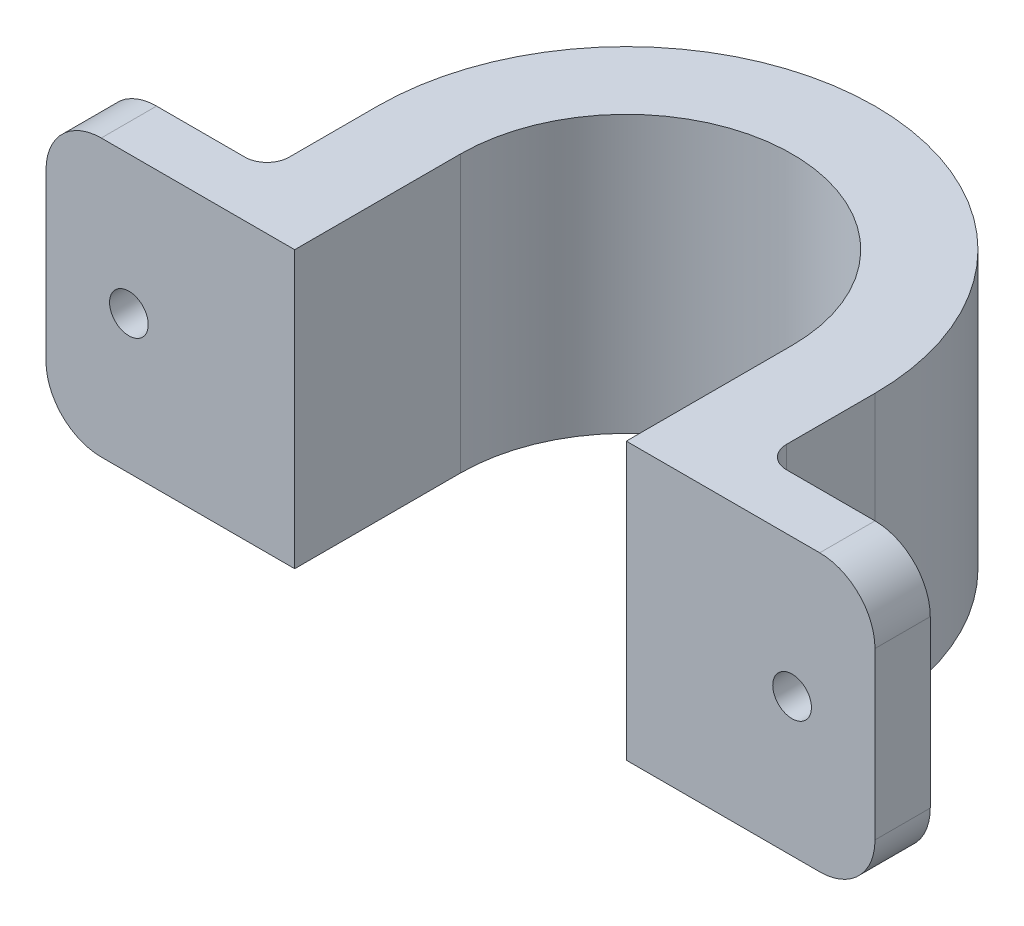
ISO-10303-21;
HEADER;
FILE_DESCRIPTION(('STEP AP214'),'2;1');
FILE_NAME('part.step','',(''),(''),'','','');
FILE_SCHEMA(('AUTOMOTIVE_DESIGN { 1 0 10303 214 1 1 1 1 }'));
ENDSEC;
DATA;
#1=APPLICATION_CONTEXT('core data for automotive mechanical design processes');
#2=APPLICATION_PROTOCOL_DEFINITION('international standard','automotive_design',2000,#1);
#3=PRODUCT_CONTEXT('',#1,'mechanical');
#4=PRODUCT('Part','Part','',(#3));
#5=PRODUCT_RELATED_PRODUCT_CATEGORY('part','',(#4));
#6=PRODUCT_DEFINITION_FORMATION('','',#4);
#7=PRODUCT_DEFINITION_CONTEXT('part definition',#1,'design');
#8=PRODUCT_DEFINITION('design','',#6,#7);
#9=PRODUCT_DEFINITION_SHAPE('','',#8);
#10=(LENGTH_UNIT() NAMED_UNIT(*) SI_UNIT(.MILLI.,.METRE.));
#11=(NAMED_UNIT(*) PLANE_ANGLE_UNIT() SI_UNIT($,.RADIAN.));
#12=(NAMED_UNIT(*) SI_UNIT($,.STERADIAN.) SOLID_ANGLE_UNIT());
#13=UNCERTAINTY_MEASURE_WITH_UNIT(LENGTH_MEASURE(1.E-05),#10,'distance_accuracy_value','');
#14=(GEOMETRIC_REPRESENTATION_CONTEXT(3) GLOBAL_UNCERTAINTY_ASSIGNED_CONTEXT((#13)) GLOBAL_UNIT_ASSIGNED_CONTEXT((#10,
#11,#12)) REPRESENTATION_CONTEXT('',''));
#15=CARTESIAN_POINT('',(0.,0.,0.));
#16=DIRECTION('',(0.,0.,1.));
#17=DIRECTION('',(1.,0.,0.));
#18=AXIS2_PLACEMENT_3D('',#15,#16,#17);
#19=CARTESIAN_POINT('',(0.,25.,15.));
#20=DIRECTION('',(-1.,0.,0.));
#21=DIRECTION('',(0.,0.,1.));
#22=AXIS2_PLACEMENT_3D('',#19,#20,#21);
#23=PLANE('',#22);
#24=DIRECTION('',(0.,0.,-1.));
#25=VECTOR('',#24,1.);
#26=CARTESIAN_POINT('',(0.,0.,15.));
#27=LINE('',#26,#25);
#28=CARTESIAN_POINT('',(0.,0.,15.));
#29=VERTEX_POINT('',#28);
#30=CARTESIAN_POINT('',(0.,0.,0.));
#31=VERTEX_POINT('',#30);
#32=EDGE_CURVE('E198',#29,#31,#27,.T.);
#33=ORIENTED_EDGE('',*,*,#32,.T.);
#34=DIRECTION('',(0.,-1.,0.));
#35=VECTOR('',#34,1.);
#36=CARTESIAN_POINT('',(0.,25.,0.));
#37=LINE('',#36,#35);
#38=CARTESIAN_POINT('',(0.,25.,0.));
#39=VERTEX_POINT('',#38);
#40=EDGE_CURVE('E175',#39,#31,#37,.T.);
#41=ORIENTED_EDGE('',*,*,#40,.F.);
#42=DIRECTION('',(0.,0.,-1.));
#43=VECTOR('',#42,1.);
#44=CARTESIAN_POINT('',(0.,25.,15.));
#45=LINE('',#44,#43);
#46=CARTESIAN_POINT('',(0.,25.,15.));
#47=VERTEX_POINT('',#46);
#48=EDGE_CURVE('E183',#47,#39,#45,.T.);
#49=ORIENTED_EDGE('',*,*,#48,.F.);
#50=DIRECTION('',(0.,-1.,0.));
#51=VECTOR('',#50,1.);
#52=CARTESIAN_POINT('',(0.,25.,15.));
#53=LINE('',#52,#51);
#54=EDGE_CURVE('E330',#47,#29,#53,.T.);
#55=ORIENTED_EDGE('',*,*,#54,.T.);
#56=EDGE_LOOP('',(#33,#41,#49,#55));
#57=FACE_BOUND('',#56,.T.);
#58=ADVANCED_FACE('F45',(#57),#23,.F.);
#59=CARTESIAN_POINT('',(15.,25.,0.));
#60=DIRECTION('',(0.,-1.,0.));
#61=DIRECTION('',(0.,0.,-1.));
#62=AXIS2_PLACEMENT_3D('',#59,#60,#61);
#63=CYLINDRICAL_SURFACE('',#62,15.);
#64=CARTESIAN_POINT('',(15.,0.,0.));
#65=DIRECTION('',(0.,-1.,0.));
#66=DIRECTION('',(0.,0.,-1.));
#67=AXIS2_PLACEMENT_3D('',#64,#65,#66);
#68=CIRCLE('',#67,15.);
#69=CARTESIAN_POINT('',(30.,0.,0.));
#70=VERTEX_POINT('',#69);
#71=EDGE_CURVE('E395',#31,#70,#68,.T.);
#72=ORIENTED_EDGE('',*,*,#71,.T.);
#73=DIRECTION('',(0.,-1.,0.));
#74=VECTOR('',#73,1.);
#75=CARTESIAN_POINT('',(30.,25.,0.));
#76=LINE('',#75,#74);
#77=CARTESIAN_POINT('',(30.,25.,0.));
#78=VERTEX_POINT('',#77);
#79=EDGE_CURVE('E178',#78,#70,#76,.T.);
#80=ORIENTED_EDGE('',*,*,#79,.F.);
#81=CARTESIAN_POINT('',(15.,25.,0.));
#82=DIRECTION('',(0.,-1.,0.));
#83=DIRECTION('',(0.,0.,-1.));
#84=AXIS2_PLACEMENT_3D('',#81,#82,#83);
#85=CIRCLE('',#84,15.);
#86=EDGE_CURVE('E171',#39,#78,#85,.T.);
#87=ORIENTED_EDGE('',*,*,#86,.F.);
#88=ORIENTED_EDGE('',*,*,#40,.T.);
#89=EDGE_LOOP('',(#72,#80,#87,#88));
#90=FACE_BOUND('',#89,.T.);
#91=ADVANCED_FACE('F173',(#90),#63,.F.);
#92=CARTESIAN_POINT('',(30.,25.,0.));
#93=DIRECTION('',(1.,0.,0.));
#94=DIRECTION('',(0.,0.,-1.));
#95=AXIS2_PLACEMENT_3D('',#92,#93,#94);
#96=PLANE('',#95);
#97=DIRECTION('',(0.,0.,1.));
#98=VECTOR('',#97,1.);
#99=CARTESIAN_POINT('',(30.,0.,0.));
#100=LINE('',#99,#98);
#101=CARTESIAN_POINT('',(30.,0.,15.));
#102=VERTEX_POINT('',#101);
#103=EDGE_CURVE('E316',#70,#102,#100,.T.);
#104=ORIENTED_EDGE('',*,*,#103,.T.);
#105=DIRECTION('',(0.,-1.,0.));
#106=VECTOR('',#105,1.);
#107=CARTESIAN_POINT('',(30.,25.,15.));
#108=LINE('',#107,#106);
#109=CARTESIAN_POINT('',(30.,25.,15.));
#110=VERTEX_POINT('',#109);
#111=EDGE_CURVE('E206',#110,#102,#108,.T.);
#112=ORIENTED_EDGE('',*,*,#111,.F.);
#113=DIRECTION('',(0.,0.,1.));
#114=VECTOR('',#113,1.);
#115=CARTESIAN_POINT('',(30.,25.,0.));
#116=LINE('',#115,#114);
#117=EDGE_CURVE('E182',#78,#110,#116,.T.);
#118=ORIENTED_EDGE('',*,*,#117,.F.);
#119=ORIENTED_EDGE('',*,*,#79,.T.);
#120=EDGE_LOOP('',(#104,#112,#118,#119));
#121=FACE_BOUND('',#120,.T.);
#122=ADVANCED_FACE('F399',(#121),#96,.F.);
#123=CARTESIAN_POINT('',(30.,25.,15.));
#124=DIRECTION('',(0.,0.,-1.));
#125=DIRECTION('',(-1.,0.,0.));
#126=AXIS2_PLACEMENT_3D('',#123,#124,#125);
#127=PLANE('',#126);
#128=CARTESIAN_POINT('',(45.,12.5,15.));
#129=DIRECTION('',(0.,0.,-1.));
#130=DIRECTION('',(-1.,0.,0.));
#131=AXIS2_PLACEMENT_3D('',#128,#129,#130);
#132=CIRCLE('',#131,1.75);
#133=CARTESIAN_POINT('',(43.25,12.5,15.));
#134=VERTEX_POINT('',#133);
#135=EDGE_CURVE('E396',#134,#134,#132,.T.);
#136=ORIENTED_EDGE('',*,*,#135,.T.);
#137=EDGE_LOOP('',(#136));
#138=FACE_BOUND('',#137,.T.);
#139=DIRECTION('',(0.,-1.,0.));
#140=VECTOR('',#139,1.);
#141=CARTESIAN_POINT('',(52.5,25.,15.));
#142=LINE('',#141,#140);
#143=CARTESIAN_POINT('',(52.5,20.,15.));
#144=VERTEX_POINT('',#143);
#145=CARTESIAN_POINT('',(52.5,5.,15.));
#146=VERTEX_POINT('',#145);
#147=EDGE_CURVE('E350',#144,#146,#142,.T.);
#148=ORIENTED_EDGE('',*,*,#147,.F.);
#149=CARTESIAN_POINT('',(47.5,20.,15.));
#150=DIRECTION('',(0.,0.,-1.));
#151=DIRECTION('',(-1.,0.,0.));
#152=AXIS2_PLACEMENT_3D('',#149,#150,#151);
#153=CIRCLE('',#152,5.);
#154=CARTESIAN_POINT('',(47.5,25.,15.));
#155=VERTEX_POINT('',#154);
#156=EDGE_CURVE('E229',#144,#155,#153,.F.);
#157=ORIENTED_EDGE('',*,*,#156,.T.);
#158=DIRECTION('',(1.,0.,0.));
#159=VECTOR('',#158,1.);
#160=CARTESIAN_POINT('',(30.,25.,15.));
#161=LINE('',#160,#159);
#162=EDGE_CURVE('E362',#110,#155,#161,.T.);
#163=ORIENTED_EDGE('',*,*,#162,.F.);
#164=ORIENTED_EDGE('',*,*,#111,.T.);
#165=DIRECTION('',(1.,0.,0.));
#166=VECTOR('',#165,1.);
#167=CARTESIAN_POINT('',(30.,0.,15.));
#168=LINE('',#167,#166);
#169=CARTESIAN_POINT('',(47.5,0.,15.));
#170=VERTEX_POINT('',#169);
#171=EDGE_CURVE('E309',#102,#170,#168,.T.);
#172=ORIENTED_EDGE('',*,*,#171,.T.);
#173=CARTESIAN_POINT('',(47.5,5.,15.));
#174=DIRECTION('',(0.,0.,-1.));
#175=DIRECTION('',(-1.,0.,0.));
#176=AXIS2_PLACEMENT_3D('',#173,#174,#175);
#177=CIRCLE('',#176,5.);
#178=EDGE_CURVE('E226',#170,#146,#177,.F.);
#179=ORIENTED_EDGE('',*,*,#178,.T.);
#180=EDGE_LOOP('',(#148,#157,#163,#164,#172,#179));
#181=FACE_BOUND('',#180,.T.);
#182=ADVANCED_FACE('F360',(#138,#181),#127,.F.);
#183=CARTESIAN_POINT('',(52.5,25.,15.));
#184=DIRECTION('',(-1.,0.,0.));
#185=DIRECTION('',(0.,0.,1.));
#186=AXIS2_PLACEMENT_3D('',#183,#184,#185);
#187=PLANE('',#186);
#188=DIRECTION('',(0.,-1.,0.));
#189=VECTOR('',#188,1.);
#190=CARTESIAN_POINT('',(52.5,25.,9.99999999999999));
#191=LINE('',#190,#189);
#192=CARTESIAN_POINT('',(52.5,20.,9.99999999999999));
#193=VERTEX_POINT('',#192);
#194=CARTESIAN_POINT('',(52.5,5.,9.99999999999999));
#195=VERTEX_POINT('',#194);
#196=EDGE_CURVE('E347',#193,#195,#191,.T.);
#197=ORIENTED_EDGE('',*,*,#196,.F.);
#198=DIRECTION('',(0.,0.,-1.));
#199=VECTOR('',#198,1.);
#200=CARTESIAN_POINT('',(52.5,20.,15.));
#201=LINE('',#200,#199);
#202=EDGE_CURVE('E223',#193,#144,#201,.F.);
#203=ORIENTED_EDGE('',*,*,#202,.T.);
#204=ORIENTED_EDGE('',*,*,#147,.T.);
#205=DIRECTION('',(0.,0.,-1.));
#206=VECTOR('',#205,1.);
#207=CARTESIAN_POINT('',(52.5,5.,9.99999999999999));
#208=LINE('',#207,#206);
#209=EDGE_CURVE('E219',#146,#195,#208,.T.);
#210=ORIENTED_EDGE('',*,*,#209,.T.);
#211=EDGE_LOOP('',(#197,#203,#204,#210));
#212=FACE_BOUND('',#211,.T.);
#213=ADVANCED_FACE('F371',(#212),#187,.F.);
#214=CARTESIAN_POINT('',(52.5,25.,9.99999999999999));
#215=DIRECTION('',(0.,0.,1.));
#216=DIRECTION('',(1.,0.,0.));
#217=AXIS2_PLACEMENT_3D('',#214,#215,#216);
#218=PLANE('',#217);
#219=CARTESIAN_POINT('',(45.,12.5,9.99999999999999));
#220=DIRECTION('',(0.,0.,-1.));
#221=DIRECTION('',(-1.,0.,0.));
#222=AXIS2_PLACEMENT_3D('',#219,#220,#221);
#223=CIRCLE('',#222,1.75);
#224=CARTESIAN_POINT('',(43.25,12.5,9.99999999999999));
#225=VERTEX_POINT('',#224);
#226=EDGE_CURVE('E616',#225,#225,#223,.T.);
#227=ORIENTED_EDGE('',*,*,#226,.F.);
#228=EDGE_LOOP('',(#227));
#229=FACE_BOUND('',#228,.T.);
#230=DIRECTION('',(-1.,0.,0.));
#231=VECTOR('',#230,1.);
#232=CARTESIAN_POINT('',(52.5,0.,9.99999999999999));
#233=LINE('',#232,#231);
#234=CARTESIAN_POINT('',(47.5,0.,9.99999999999999));
#235=VERTEX_POINT('',#234);
#236=CARTESIAN_POINT('',(39.5,0.,9.99999999999999));
#237=VERTEX_POINT('',#236);
#238=EDGE_CURVE('E301',#235,#237,#233,.T.);
#239=ORIENTED_EDGE('',*,*,#238,.T.);
#240=DIRECTION('',(0.,-1.,0.));
#241=VECTOR('',#240,1.);
#242=CARTESIAN_POINT('',(39.5,25.,9.99999999999999));
#243=LINE('',#242,#241);
#244=CARTESIAN_POINT('',(39.5,25.,9.99999999999999));
#245=VERTEX_POINT('',#244);
#246=EDGE_CURVE('E263',#237,#245,#243,.F.);
#247=ORIENTED_EDGE('',*,*,#246,.T.);
#248=DIRECTION('',(-1.,0.,0.));
#249=VECTOR('',#248,1.);
#250=CARTESIAN_POINT('',(52.5,25.,9.99999999999999));
#251=LINE('',#250,#249);
#252=CARTESIAN_POINT('',(47.5,25.,9.99999999999999));
#253=VERTEX_POINT('',#252);
#254=EDGE_CURVE('E284',#253,#245,#251,.T.);
#255=ORIENTED_EDGE('',*,*,#254,.F.);
#256=CARTESIAN_POINT('',(47.5,20.,9.99999999999999));
#257=DIRECTION('',(0.,0.,1.));
#258=DIRECTION('',(1.,0.,0.));
#259=AXIS2_PLACEMENT_3D('',#256,#257,#258);
#260=CIRCLE('',#259,5.);
#261=EDGE_CURVE('E216',#253,#193,#260,.F.);
#262=ORIENTED_EDGE('',*,*,#261,.T.);
#263=ORIENTED_EDGE('',*,*,#196,.T.);
#264=CARTESIAN_POINT('',(47.5,5.,9.99999999999999));
#265=DIRECTION('',(0.,0.,1.));
#266=DIRECTION('',(1.,0.,0.));
#267=AXIS2_PLACEMENT_3D('',#264,#265,#266);
#268=CIRCLE('',#267,5.);
#269=EDGE_CURVE('E213',#195,#235,#268,.F.);
#270=ORIENTED_EDGE('',*,*,#269,.T.);
#271=EDGE_LOOP('',(#239,#247,#255,#262,#263,#270));
#272=FACE_BOUND('',#271,.T.);
#273=ADVANCED_FACE('F306',(#229,#272),#218,.F.);
#274=CARTESIAN_POINT('',(37.5,25.,9.99999999999999));
#275=DIRECTION('',(-1.,0.,0.));
#276=DIRECTION('',(0.,0.,1.));
#277=AXIS2_PLACEMENT_3D('',#274,#275,#276);
#278=PLANE('',#277);
#279=DIRECTION('',(0.,0.,-1.));
#280=VECTOR('',#279,1.);
#281=CARTESIAN_POINT('',(37.5,25.,9.99999999999999));
#282=LINE('',#281,#280);
#283=CARTESIAN_POINT('',(37.5,25.,7.99999999999999));
#284=VERTEX_POINT('',#283);
#285=CARTESIAN_POINT('',(37.5,25.,0.));
#286=VERTEX_POINT('',#285);
#287=EDGE_CURVE('E281',#284,#286,#282,.T.);
#288=ORIENTED_EDGE('',*,*,#287,.F.);
#289=DIRECTION('',(0.,-1.,0.));
#290=VECTOR('',#289,1.);
#291=CARTESIAN_POINT('',(37.5,0.,7.99999999999999));
#292=LINE('',#291,#290);
#293=CARTESIAN_POINT('',(37.5,0.,7.99999999999999));
#294=VERTEX_POINT('',#293);
#295=EDGE_CURVE('E259',#284,#294,#292,.T.);
#296=ORIENTED_EDGE('',*,*,#295,.T.);
#297=DIRECTION('',(0.,0.,-1.));
#298=VECTOR('',#297,1.);
#299=CARTESIAN_POINT('',(37.5,0.,9.99999999999999));
#300=LINE('',#299,#298);
#301=CARTESIAN_POINT('',(37.5,0.,0.));
#302=VERTEX_POINT('',#301);
#303=EDGE_CURVE('E304',#294,#302,#300,.T.);
#304=ORIENTED_EDGE('',*,*,#303,.T.);
#305=DIRECTION('',(0.,-1.,0.));
#306=VECTOR('',#305,1.);
#307=CARTESIAN_POINT('',(37.5,25.,0.));
#308=LINE('',#307,#306);
#309=EDGE_CURVE('E292',#286,#302,#308,.T.);
#310=ORIENTED_EDGE('',*,*,#309,.F.);
#311=EDGE_LOOP('',(#288,#296,#304,#310));
#312=FACE_BOUND('',#311,.T.);
#313=ADVANCED_FACE('F289',(#312),#278,.F.);
#314=CARTESIAN_POINT('',(15.,25.,0.));
#315=DIRECTION('',(0.,-1.,0.));
#316=DIRECTION('',(0.,0.,-1.));
#317=AXIS2_PLACEMENT_3D('',#314,#315,#316);
#318=CYLINDRICAL_SURFACE('',#317,22.5);
#319=CARTESIAN_POINT('',(15.,0.,0.));
#320=DIRECTION('',(0.,1.,0.));
#321=DIRECTION('',(0.,0.,-1.));
#322=AXIS2_PLACEMENT_3D('',#319,#320,#321);
#323=CIRCLE('',#322,22.5);
#324=CARTESIAN_POINT('',(-7.5,0.,0.));
#325=VERTEX_POINT('',#324);
#326=EDGE_CURVE('E313',#302,#325,#323,.T.);
#327=ORIENTED_EDGE('',*,*,#326,.T.);
#328=DIRECTION('',(0.,-1.,0.));
#329=VECTOR('',#328,1.);
#330=CARTESIAN_POINT('',(-7.5,25.,0.));
#331=LINE('',#330,#329);
#332=CARTESIAN_POINT('',(-7.5,25.,0.));
#333=VERTEX_POINT('',#332);
#334=EDGE_CURVE('E341',#333,#325,#331,.T.);
#335=ORIENTED_EDGE('',*,*,#334,.F.);
#336=CARTESIAN_POINT('',(15.,25.,0.));
#337=DIRECTION('',(0.,1.,0.));
#338=DIRECTION('',(0.,0.,-1.));
#339=AXIS2_PLACEMENT_3D('',#336,#337,#338);
#340=CIRCLE('',#339,22.5);
#341=EDGE_CURVE('E295',#286,#333,#340,.T.);
#342=ORIENTED_EDGE('',*,*,#341,.F.);
#343=ORIENTED_EDGE('',*,*,#309,.T.);
#344=EDGE_LOOP('',(#327,#335,#342,#343));
#345=FACE_BOUND('',#344,.T.);
#346=ADVANCED_FACE('F469',(#345),#318,.T.);
#347=CARTESIAN_POINT('',(-7.5,25.,0.));
#348=DIRECTION('',(1.,0.,0.));
#349=DIRECTION('',(0.,0.,-1.));
#350=AXIS2_PLACEMENT_3D('',#347,#348,#349);
#351=PLANE('',#350);
#352=DIRECTION('',(0.,0.,1.));
#353=VECTOR('',#352,1.);
#354=CARTESIAN_POINT('',(-7.5,0.,0.));
#355=LINE('',#354,#353);
#356=CARTESIAN_POINT('',(-7.5,0.,8.));
#357=VERTEX_POINT('',#356);
#358=EDGE_CURVE('E322',#325,#357,#355,.T.);
#359=ORIENTED_EDGE('',*,*,#358,.T.);
#360=DIRECTION('',(0.,-1.,0.));
#361=VECTOR('',#360,1.);
#362=CARTESIAN_POINT('',(-7.5,25.,8.));
#363=LINE('',#362,#361);
#364=CARTESIAN_POINT('',(-7.5,25.,8.));
#365=VERTEX_POINT('',#364);
#366=EDGE_CURVE('E61',#357,#365,#363,.F.);
#367=ORIENTED_EDGE('',*,*,#366,.T.);
#368=DIRECTION('',(0.,0.,1.));
#369=VECTOR('',#368,1.);
#370=CARTESIAN_POINT('',(-7.5,25.,0.));
#371=LINE('',#370,#369);
#372=EDGE_CURVE('E385',#333,#365,#371,.T.);
#373=ORIENTED_EDGE('',*,*,#372,.F.);
#374=ORIENTED_EDGE('',*,*,#334,.T.);
#375=EDGE_LOOP('',(#359,#367,#373,#374));
#376=FACE_BOUND('',#375,.T.);
#377=ADVANCED_FACE('F462',(#376),#351,.F.);
#378=CARTESIAN_POINT('',(-7.5,25.,10.));
#379=DIRECTION('',(0.,0.,1.));
#380=DIRECTION('',(1.,0.,0.));
#381=AXIS2_PLACEMENT_3D('',#378,#379,#380);
#382=PLANE('',#381);
#383=CARTESIAN_POINT('',(-15.,12.5,10.));
#384=DIRECTION('',(0.,0.,-1.));
#385=DIRECTION('',(1.,0.,0.));
#386=AXIS2_PLACEMENT_3D('',#383,#384,#385);
#387=CIRCLE('',#386,1.75);
#388=CARTESIAN_POINT('',(-13.25,12.5,10.));
#389=VERTEX_POINT('',#388);
#390=EDGE_CURVE('E614',#389,#389,#387,.T.);
#391=ORIENTED_EDGE('',*,*,#390,.F.);
#392=EDGE_LOOP('',(#391));
#393=FACE_BOUND('',#392,.T.);
#394=DIRECTION('',(-1.,0.,0.));
#395=VECTOR('',#394,1.);
#396=CARTESIAN_POINT('',(-7.5,25.,10.));
#397=LINE('',#396,#395);
#398=CARTESIAN_POINT('',(-9.5,25.,10.));
#399=VERTEX_POINT('',#398);
#400=CARTESIAN_POINT('',(-17.5,25.,10.));
#401=VERTEX_POINT('',#400);
#402=EDGE_CURVE('E388',#399,#401,#397,.T.);
#403=ORIENTED_EDGE('',*,*,#402,.F.);
#404=DIRECTION('',(0.,-1.,0.));
#405=VECTOR('',#404,1.);
#406=CARTESIAN_POINT('',(-9.5,0.,10.));
#407=LINE('',#406,#405);
#408=CARTESIAN_POINT('',(-9.5,0.,10.));
#409=VERTEX_POINT('',#408);
#410=EDGE_CURVE('E266',#399,#409,#407,.T.);
#411=ORIENTED_EDGE('',*,*,#410,.T.);
#412=DIRECTION('',(-1.,0.,0.));
#413=VECTOR('',#412,1.);
#414=CARTESIAN_POINT('',(-7.5,0.,10.));
#415=LINE('',#414,#413);
#416=CARTESIAN_POINT('',(-17.5,0.,10.));
#417=VERTEX_POINT('',#416);
#418=EDGE_CURVE('E325',#409,#417,#415,.T.);
#419=ORIENTED_EDGE('',*,*,#418,.T.);
#420=CARTESIAN_POINT('',(-17.5,5.,10.));
#421=DIRECTION('',(0.,0.,1.));
#422=DIRECTION('',(1.,0.,0.));
#423=AXIS2_PLACEMENT_3D('',#420,#421,#422);
#424=CIRCLE('',#423,5.);
#425=CARTESIAN_POINT('',(-22.5,5.,10.));
#426=VERTEX_POINT('',#425);
#427=EDGE_CURVE('E252',#417,#426,#424,.F.);
#428=ORIENTED_EDGE('',*,*,#427,.T.);
#429=DIRECTION('',(0.,-1.,0.));
#430=VECTOR('',#429,1.);
#431=CARTESIAN_POINT('',(-22.5,25.,10.));
#432=LINE('',#431,#430);
#433=CARTESIAN_POINT('',(-22.5,20.,10.));
#434=VERTEX_POINT('',#433);
#435=EDGE_CURVE('E337',#434,#426,#432,.T.);
#436=ORIENTED_EDGE('',*,*,#435,.F.);
#437=CARTESIAN_POINT('',(-17.5,20.,10.));
#438=DIRECTION('',(0.,0.,1.));
#439=DIRECTION('',(1.,0.,0.));
#440=AXIS2_PLACEMENT_3D('',#437,#438,#439);
#441=CIRCLE('',#440,5.);
#442=EDGE_CURVE('E255',#434,#401,#441,.F.);
#443=ORIENTED_EDGE('',*,*,#442,.T.);
#444=EDGE_LOOP('',(#403,#411,#419,#428,#436,#443));
#445=FACE_BOUND('',#444,.T.);
#446=ADVANCED_FACE('F439',(#393,#445),#382,.F.);
#447=CARTESIAN_POINT('',(-22.5,25.,10.));
#448=DIRECTION('',(1.,0.,0.));
#449=DIRECTION('',(0.,0.,-1.));
#450=AXIS2_PLACEMENT_3D('',#447,#448,#449);
#451=PLANE('',#450);
#452=DIRECTION('',(0.,-1.,0.));
#453=VECTOR('',#452,1.);
#454=CARTESIAN_POINT('',(-22.5,25.,15.));
#455=LINE('',#454,#453);
#456=CARTESIAN_POINT('',(-22.5,20.,15.));
#457=VERTEX_POINT('',#456);
#458=CARTESIAN_POINT('',(-22.5,5.,15.));
#459=VERTEX_POINT('',#458);
#460=EDGE_CURVE('E333',#457,#459,#455,.T.);
#461=ORIENTED_EDGE('',*,*,#460,.F.);
#462=DIRECTION('',(0.,0.,1.));
#463=VECTOR('',#462,1.);
#464=CARTESIAN_POINT('',(-22.5,20.,10.));
#465=LINE('',#464,#463);
#466=EDGE_CURVE('E249',#457,#434,#465,.F.);
#467=ORIENTED_EDGE('',*,*,#466,.T.);
#468=ORIENTED_EDGE('',*,*,#435,.T.);
#469=DIRECTION('',(0.,0.,1.));
#470=VECTOR('',#469,1.);
#471=CARTESIAN_POINT('',(-22.5,5.,15.));
#472=LINE('',#471,#470);
#473=EDGE_CURVE('E245',#426,#459,#472,.T.);
#474=ORIENTED_EDGE('',*,*,#473,.T.);
#475=EDGE_LOOP('',(#461,#467,#468,#474));
#476=FACE_BOUND('',#475,.T.);
#477=ADVANCED_FACE('F452',(#476),#451,.F.);
#478=CARTESIAN_POINT('',(-22.5,25.,15.));
#479=DIRECTION('',(0.,0.,-1.));
#480=DIRECTION('',(-1.,0.,0.));
#481=AXIS2_PLACEMENT_3D('',#478,#479,#480);
#482=PLANE('',#481);
#483=CARTESIAN_POINT('',(-15.,12.5,15.));
#484=DIRECTION('',(0.,0.,-1.));
#485=DIRECTION('',(1.,0.,0.));
#486=AXIS2_PLACEMENT_3D('',#483,#484,#485);
#487=CIRCLE('',#486,1.75);
#488=CARTESIAN_POINT('',(-13.25,12.5,15.));
#489=VERTEX_POINT('',#488);
#490=EDGE_CURVE('E611',#489,#489,#487,.T.);
#491=ORIENTED_EDGE('',*,*,#490,.T.);
#492=EDGE_LOOP('',(#491));
#493=FACE_BOUND('',#492,.T.);
#494=DIRECTION('',(1.,0.,0.));
#495=VECTOR('',#494,1.);
#496=CARTESIAN_POINT('',(-22.5,25.,15.));
#497=LINE('',#496,#495);
#498=CARTESIAN_POINT('',(-17.5,25.,15.));
#499=VERTEX_POINT('',#498);
#500=EDGE_CURVE('E190',#499,#47,#497,.T.);
#501=ORIENTED_EDGE('',*,*,#500,.F.);
#502=CARTESIAN_POINT('',(-17.5,20.,15.));
#503=DIRECTION('',(0.,0.,-1.));
#504=DIRECTION('',(-1.,0.,0.));
#505=AXIS2_PLACEMENT_3D('',#502,#503,#504);
#506=CIRCLE('',#505,5.);
#507=EDGE_CURVE('E242',#499,#457,#506,.F.);
#508=ORIENTED_EDGE('',*,*,#507,.T.);
#509=ORIENTED_EDGE('',*,*,#460,.T.);
#510=CARTESIAN_POINT('',(-17.5,5.,15.));
#511=DIRECTION('',(0.,0.,-1.));
#512=DIRECTION('',(-1.,0.,0.));
#513=AXIS2_PLACEMENT_3D('',#510,#511,#512);
#514=CIRCLE('',#513,5.);
#515=CARTESIAN_POINT('',(-17.5,0.,15.));
#516=VERTEX_POINT('',#515);
#517=EDGE_CURVE('E239',#459,#516,#514,.F.);
#518=ORIENTED_EDGE('',*,*,#517,.T.);
#519=DIRECTION('',(1.,0.,0.));
#520=VECTOR('',#519,1.);
#521=CARTESIAN_POINT('',(-22.5,0.,15.));
#522=LINE('',#521,#520);
#523=EDGE_CURVE('E195',#516,#29,#522,.T.);
#524=ORIENTED_EDGE('',*,*,#523,.T.);
#525=ORIENTED_EDGE('',*,*,#54,.F.);
#526=EDGE_LOOP('',(#501,#508,#509,#518,#524,#525));
#527=FACE_BOUND('',#526,.T.);
#528=ADVANCED_FACE('F445',(#493,#527),#482,.F.);
#529=CARTESIAN_POINT('',(15.,25.,0.));
#530=DIRECTION('',(0.,-1.,0.));
#531=DIRECTION('',(0.,0.,-1.));
#532=AXIS2_PLACEMENT_3D('',#529,#530,#531);
#533=PLANE('',#532);
#534=ORIENTED_EDGE('',*,*,#162,.T.);
#535=DIRECTION('',(0.,0.,-1.));
#536=VECTOR('',#535,1.);
#537=CARTESIAN_POINT('',(47.5,25.,0.));
#538=LINE('',#537,#536);
#539=EDGE_CURVE('E204',#155,#253,#538,.T.);
#540=ORIENTED_EDGE('',*,*,#539,.T.);
#541=ORIENTED_EDGE('',*,*,#254,.T.);
#542=CARTESIAN_POINT('',(39.5,25.,7.99999999999999));
#543=DIRECTION('',(0.,-1.,0.));
#544=DIRECTION('',(0.,0.,-1.));
#545=AXIS2_PLACEMENT_3D('',#542,#543,#544);
#546=CIRCLE('',#545,2.);
#547=EDGE_CURVE('E275',#245,#284,#546,.T.);
#548=ORIENTED_EDGE('',*,*,#547,.T.);
#549=ORIENTED_EDGE('',*,*,#287,.T.);
#550=ORIENTED_EDGE('',*,*,#341,.T.);
#551=ORIENTED_EDGE('',*,*,#372,.T.);
#552=CARTESIAN_POINT('',(-9.5,25.,8.));
#553=DIRECTION('',(0.,-1.,0.));
#554=DIRECTION('',(0.,0.,-1.));
#555=AXIS2_PLACEMENT_3D('',#552,#553,#554);
#556=CIRCLE('',#555,2.);
#557=EDGE_CURVE('E11',#365,#399,#556,.T.);
#558=ORIENTED_EDGE('',*,*,#557,.T.);
#559=ORIENTED_EDGE('',*,*,#402,.T.);
#560=DIRECTION('',(0.,0.,1.));
#561=VECTOR('',#560,1.);
#562=CARTESIAN_POINT('',(-17.5,25.,0.));
#563=LINE('',#562,#561);
#564=EDGE_CURVE('E200',#401,#499,#563,.T.);
#565=ORIENTED_EDGE('',*,*,#564,.T.);
#566=ORIENTED_EDGE('',*,*,#500,.T.);
#567=ORIENTED_EDGE('',*,*,#48,.T.);
#568=ORIENTED_EDGE('',*,*,#86,.T.);
#569=ORIENTED_EDGE('',*,*,#117,.T.);
#570=EDGE_LOOP('',(#534,#540,#541,#548,#549,#550,#551,#558,#559,#565,#566,#567,#568,#569));
#571=FACE_BOUND('',#570,.T.);
#572=ADVANCED_FACE('F187',(#571),#533,.F.);
#573=CARTESIAN_POINT('',(15.,0.,0.));
#574=DIRECTION('',(0.,-1.,0.));
#575=DIRECTION('',(0.,0.,-1.));
#576=AXIS2_PLACEMENT_3D('',#573,#574,#575);
#577=PLANE('',#576);
#578=ORIENTED_EDGE('',*,*,#238,.F.);
#579=DIRECTION('',(0.,0.,-1.));
#580=VECTOR('',#579,1.);
#581=CARTESIAN_POINT('',(47.5,0.,15.));
#582=LINE('',#581,#580);
#583=EDGE_CURVE('E236',#235,#170,#582,.F.);
#584=ORIENTED_EDGE('',*,*,#583,.T.);
#585=ORIENTED_EDGE('',*,*,#171,.F.);
#586=ORIENTED_EDGE('',*,*,#103,.F.);
#587=ORIENTED_EDGE('',*,*,#71,.F.);
#588=ORIENTED_EDGE('',*,*,#32,.F.);
#589=ORIENTED_EDGE('',*,*,#523,.F.);
#590=DIRECTION('',(0.,0.,1.));
#591=VECTOR('',#590,1.);
#592=CARTESIAN_POINT('',(-17.5,0.,10.));
#593=LINE('',#592,#591);
#594=EDGE_CURVE('E232',#516,#417,#593,.F.);
#595=ORIENTED_EDGE('',*,*,#594,.T.);
#596=ORIENTED_EDGE('',*,*,#418,.F.);
#597=CARTESIAN_POINT('',(-9.5,0.,8.));
#598=DIRECTION('',(0.,-1.,0.));
#599=DIRECTION('',(0.,0.,-1.));
#600=AXIS2_PLACEMENT_3D('',#597,#598,#599);
#601=CIRCLE('',#600,2.);
#602=EDGE_CURVE('E54',#409,#357,#601,.F.);
#603=ORIENTED_EDGE('',*,*,#602,.T.);
#604=ORIENTED_EDGE('',*,*,#358,.F.);
#605=ORIENTED_EDGE('',*,*,#326,.F.);
#606=ORIENTED_EDGE('',*,*,#303,.F.);
#607=CARTESIAN_POINT('',(39.5,0.,7.99999999999999));
#608=DIRECTION('',(0.,-1.,0.));
#609=DIRECTION('',(0.,0.,-1.));
#610=AXIS2_PLACEMENT_3D('',#607,#608,#609);
#611=CIRCLE('',#610,2.);
#612=EDGE_CURVE('E272',#294,#237,#611,.F.);
#613=ORIENTED_EDGE('',*,*,#612,.T.);
#614=EDGE_LOOP('',(#578,#584,#585,#586,#587,#588,#589,#595,#596,#603,#604,#605,#606,#613));
#615=FACE_BOUND('',#614,.T.);
#616=ADVANCED_FACE('F300',(#615),#577,.T.);
#617=CARTESIAN_POINT('',(-15.,12.5,15.));
#618=DIRECTION('',(0.,0.,-1.));
#619=DIRECTION('',(-1.,0.,0.));
#620=AXIS2_PLACEMENT_3D('',#617,#618,#619);
#621=CYLINDRICAL_SURFACE('',#620,1.75);
#622=ORIENTED_EDGE('',*,*,#490,.F.);
#623=EDGE_LOOP('',(#622));
#624=FACE_BOUND('',#623,.T.);
#625=ORIENTED_EDGE('',*,*,#390,.T.);
#626=EDGE_LOOP('',(#625));
#627=FACE_BOUND('',#626,.T.);
#628=ADVANCED_FACE('F492',(#624,#627),#621,.F.);
#629=CARTESIAN_POINT('',(45.,12.5,15.));
#630=DIRECTION('',(0.,0.,-1.));
#631=DIRECTION('',(-1.,0.,0.));
#632=AXIS2_PLACEMENT_3D('',#629,#630,#631);
#633=CYLINDRICAL_SURFACE('',#632,1.75);
#634=ORIENTED_EDGE('',*,*,#135,.F.);
#635=EDGE_LOOP('',(#634));
#636=FACE_BOUND('',#635,.T.);
#637=ORIENTED_EDGE('',*,*,#226,.T.);
#638=EDGE_LOOP('',(#637));
#639=FACE_BOUND('',#638,.T.);
#640=ADVANCED_FACE('F417',(#636,#639),#633,.F.);
#641=CARTESIAN_POINT('',(47.5,20.,0.));
#642=DIRECTION('',(0.,0.,-1.));
#643=DIRECTION('',(-1.,0.,0.));
#644=AXIS2_PLACEMENT_3D('',#641,#642,#643);
#645=CYLINDRICAL_SURFACE('',#644,5.);
#646=ORIENTED_EDGE('',*,*,#156,.F.);
#647=ORIENTED_EDGE('',*,*,#202,.F.);
#648=ORIENTED_EDGE('',*,*,#261,.F.);
#649=ORIENTED_EDGE('',*,*,#539,.F.);
#650=EDGE_LOOP('',(#646,#647,#648,#649));
#651=FACE_BOUND('',#650,.T.);
#652=ADVANCED_FACE('F374',(#651),#645,.T.);
#653=CARTESIAN_POINT('',(47.5,5.,15.));
#654=DIRECTION('',(0.,0.,1.));
#655=DIRECTION('',(1.,0.,0.));
#656=AXIS2_PLACEMENT_3D('',#653,#654,#655);
#657=CYLINDRICAL_SURFACE('',#656,5.);
#658=ORIENTED_EDGE('',*,*,#178,.F.);
#659=ORIENTED_EDGE('',*,*,#583,.F.);
#660=ORIENTED_EDGE('',*,*,#269,.F.);
#661=ORIENTED_EDGE('',*,*,#209,.F.);
#662=EDGE_LOOP('',(#658,#659,#660,#661));
#663=FACE_BOUND('',#662,.T.);
#664=ADVANCED_FACE('F366',(#663),#657,.T.);
#665=CARTESIAN_POINT('',(-17.5,20.,0.));
#666=DIRECTION('',(0.,0.,1.));
#667=DIRECTION('',(1.,0.,0.));
#668=AXIS2_PLACEMENT_3D('',#665,#666,#667);
#669=CYLINDRICAL_SURFACE('',#668,5.);
#670=ORIENTED_EDGE('',*,*,#442,.F.);
#671=ORIENTED_EDGE('',*,*,#466,.F.);
#672=ORIENTED_EDGE('',*,*,#507,.F.);
#673=ORIENTED_EDGE('',*,*,#564,.F.);
#674=EDGE_LOOP('',(#670,#671,#672,#673));
#675=FACE_BOUND('',#674,.T.);
#676=ADVANCED_FACE('F420',(#675),#669,.T.);
#677=CARTESIAN_POINT('',(-17.5,5.,10.));
#678=DIRECTION('',(0.,0.,-1.));
#679=DIRECTION('',(-1.,0.,0.));
#680=AXIS2_PLACEMENT_3D('',#677,#678,#679);
#681=CYLINDRICAL_SURFACE('',#680,5.);
#682=ORIENTED_EDGE('',*,*,#427,.F.);
#683=ORIENTED_EDGE('',*,*,#594,.F.);
#684=ORIENTED_EDGE('',*,*,#517,.F.);
#685=ORIENTED_EDGE('',*,*,#473,.F.);
#686=EDGE_LOOP('',(#682,#683,#684,#685));
#687=FACE_BOUND('',#686,.T.);
#688=ADVANCED_FACE('F423',(#687),#681,.T.);
#689=CARTESIAN_POINT('',(39.5,25.,7.99999999999999));
#690=DIRECTION('',(0.,1.,0.));
#691=DIRECTION('',(0.,0.,1.));
#692=AXIS2_PLACEMENT_3D('',#689,#690,#691);
#693=CYLINDRICAL_SURFACE('',#692,2.);
#694=ORIENTED_EDGE('',*,*,#547,.F.);
#695=ORIENTED_EDGE('',*,*,#246,.F.);
#696=ORIENTED_EDGE('',*,*,#612,.F.);
#697=ORIENTED_EDGE('',*,*,#295,.F.);
#698=EDGE_LOOP('',(#694,#695,#696,#697));
#699=FACE_BOUND('',#698,.T.);
#700=ADVANCED_FACE('F297',(#699),#693,.F.);
#701=CARTESIAN_POINT('',(-9.5,25.,8.));
#702=DIRECTION('',(0.,1.,0.));
#703=DIRECTION('',(0.,0.,1.));
#704=AXIS2_PLACEMENT_3D('',#701,#702,#703);
#705=CYLINDRICAL_SURFACE('',#704,2.);
#706=ORIENTED_EDGE('',*,*,#557,.F.);
#707=ORIENTED_EDGE('',*,*,#366,.F.);
#708=ORIENTED_EDGE('',*,*,#602,.F.);
#709=ORIENTED_EDGE('',*,*,#410,.F.);
#710=EDGE_LOOP('',(#706,#707,#708,#709));
#711=FACE_BOUND('',#710,.T.);
#712=ADVANCED_FACE('F47',(#711),#705,.F.);
#713=CLOSED_SHELL('',(#58,#91,#122,#182,#213,#273,#313,#346,#377,#446,#477,#528,#572,#616,#628,
#640,#652,#664,#676,#688,#700,#712));
#714=MANIFOLD_SOLID_BREP('B2',#713);
#715=ADVANCED_BREP_SHAPE_REPRESENTATION('',(#18,#714),#14);
#716=SHAPE_DEFINITION_REPRESENTATION(#9,#715);
ENDSEC;
END-ISO-10303-21;
